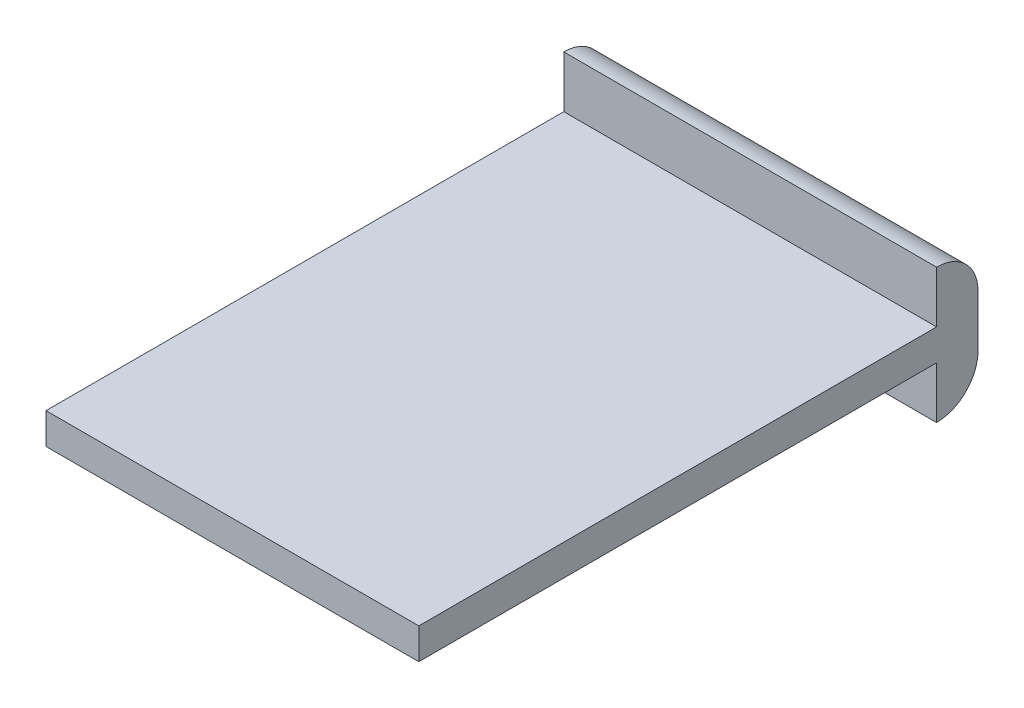
ISO-10303-21;
HEADER;
FILE_DESCRIPTION(('STEP AP214'),'2;1');
FILE_NAME('part.step','',(''),(''),'','','');
FILE_SCHEMA(('AUTOMOTIVE_DESIGN { 1 0 10303 214 1 1 1 1 }'));
ENDSEC;
DATA;
#1=APPLICATION_CONTEXT('core data for automotive mechanical design processes');
#2=APPLICATION_PROTOCOL_DEFINITION('international standard','automotive_design',2000,#1);
#3=PRODUCT_CONTEXT('',#1,'mechanical');
#4=PRODUCT('Part','Part','',(#3));
#5=PRODUCT_RELATED_PRODUCT_CATEGORY('part','',(#4));
#6=PRODUCT_DEFINITION_FORMATION('','',#4);
#7=PRODUCT_DEFINITION_CONTEXT('part definition',#1,'design');
#8=PRODUCT_DEFINITION('design','',#6,#7);
#9=PRODUCT_DEFINITION_SHAPE('','',#8);
#10=(LENGTH_UNIT() NAMED_UNIT(*) SI_UNIT(.MILLI.,.METRE.));
#11=(NAMED_UNIT(*) PLANE_ANGLE_UNIT() SI_UNIT($,.RADIAN.));
#12=(NAMED_UNIT(*) SI_UNIT($,.STERADIAN.) SOLID_ANGLE_UNIT());
#13=UNCERTAINTY_MEASURE_WITH_UNIT(LENGTH_MEASURE(1.E-05),#10,'distance_accuracy_value','');
#14=(GEOMETRIC_REPRESENTATION_CONTEXT(3) GLOBAL_UNCERTAINTY_ASSIGNED_CONTEXT((#13)) GLOBAL_UNIT_ASSIGNED_CONTEXT((#10,
#11,#12)) REPRESENTATION_CONTEXT('',''));
#15=CARTESIAN_POINT('',(0.,0.,0.));
#16=DIRECTION('',(0.,0.,1.));
#17=DIRECTION('',(1.,0.,0.));
#18=AXIS2_PLACEMENT_3D('',#15,#16,#17);
#19=CARTESIAN_POINT('',(0.,1.5,0.));
#20=DIRECTION('',(1.,0.,0.));
#21=DIRECTION('',(0.,0.,-1.));
#22=AXIS2_PLACEMENT_3D('',#19,#20,#21);
#23=PLANE('',#22);
#24=DIRECTION('',(0.,1.,0.));
#25=VECTOR('',#24,1.);
#26=CARTESIAN_POINT('',(0.,-2.5,-25.));
#27=LINE('',#26,#25);
#28=CARTESIAN_POINT('',(0.,1.5,-25.));
#29=VERTEX_POINT('',#28);
#30=CARTESIAN_POINT('',(0.,4.,-25.));
#31=VERTEX_POINT('',#30);
#32=EDGE_CURVE('E115',#29,#31,#27,.T.);
#33=ORIENTED_EDGE('',*,*,#32,.T.);
#34=CARTESIAN_POINT('',(0.,2.,-25.));
#35=DIRECTION('',(1.,0.,0.));
#36=DIRECTION('',(0.,0.,-1.));
#37=AXIS2_PLACEMENT_3D('',#34,#35,#36);
#38=CIRCLE('',#37,2.);
#39=CARTESIAN_POINT('',(0.,2.,-27.));
#40=VERTEX_POINT('',#39);
#41=EDGE_CURVE('E11',#31,#40,#38,.F.);
#42=ORIENTED_EDGE('',*,*,#41,.T.);
#43=DIRECTION('',(0.,1.,0.));
#44=VECTOR('',#43,1.);
#45=CARTESIAN_POINT('',(0.,-2.5,-27.));
#46=LINE('',#45,#44);
#47=CARTESIAN_POINT('',(0.,-0.500000000000001,-27.));
#48=VERTEX_POINT('',#47);
#49=EDGE_CURVE('E127',#48,#40,#46,.T.);
#50=ORIENTED_EDGE('',*,*,#49,.F.);
#51=CARTESIAN_POINT('',(0.,-0.5,-25.));
#52=DIRECTION('',(1.,0.,0.));
#53=DIRECTION('',(0.,0.,-1.));
#54=AXIS2_PLACEMENT_3D('',#51,#52,#53);
#55=CIRCLE('',#54,2.);
#56=CARTESIAN_POINT('',(0.,-2.5,-25.));
#57=VERTEX_POINT('',#56);
#58=EDGE_CURVE('E41',#48,#57,#55,.F.);
#59=ORIENTED_EDGE('',*,*,#58,.T.);
#60=CARTESIAN_POINT('',(0.,0.,-25.));
#61=VERTEX_POINT('',#60);
#62=EDGE_CURVE('E114',#57,#61,#27,.T.);
#63=ORIENTED_EDGE('',*,*,#62,.T.);
#64=DIRECTION('',(0.,0.,1.));
#65=VECTOR('',#64,1.);
#66=CARTESIAN_POINT('',(0.,0.,0.));
#67=LINE('',#66,#65);
#68=CARTESIAN_POINT('',(0.,0.,0.));
#69=VERTEX_POINT('',#68);
#70=EDGE_CURVE('E130',#61,#69,#67,.T.);
#71=ORIENTED_EDGE('',*,*,#70,.T.);
#72=DIRECTION('',(0.,-1.,0.));
#73=VECTOR('',#72,1.);
#74=CARTESIAN_POINT('',(0.,1.5,0.));
#75=LINE('',#74,#73);
#76=CARTESIAN_POINT('',(0.,1.5,0.));
#77=VERTEX_POINT('',#76);
#78=EDGE_CURVE('E190',#77,#69,#75,.T.);
#79=ORIENTED_EDGE('',*,*,#78,.F.);
#80=DIRECTION('',(0.,0.,1.));
#81=VECTOR('',#80,1.);
#82=CARTESIAN_POINT('',(0.,1.5,0.));
#83=LINE('',#82,#81);
#84=EDGE_CURVE('E154',#29,#77,#83,.T.);
#85=ORIENTED_EDGE('',*,*,#84,.F.);
#86=EDGE_LOOP('',(#33,#42,#50,#59,#63,#71,#79,#85));
#87=FACE_BOUND('',#86,.T.);
#88=ADVANCED_FACE('F33',(#87),#23,.F.);
#89=CARTESIAN_POINT('',(0.,1.5,0.));
#90=DIRECTION('',(0.,0.,-1.));
#91=DIRECTION('',(-1.,0.,0.));
#92=AXIS2_PLACEMENT_3D('',#89,#90,#91);
#93=PLANE('',#92);
#94=DIRECTION('',(1.,0.,0.));
#95=VECTOR('',#94,1.);
#96=CARTESIAN_POINT('',(0.,0.,0.));
#97=LINE('',#96,#95);
#98=CARTESIAN_POINT('',(18.,0.,0.));
#99=VERTEX_POINT('',#98);
#100=EDGE_CURVE('E133',#69,#99,#97,.T.);
#101=ORIENTED_EDGE('',*,*,#100,.T.);
#102=DIRECTION('',(0.,-1.,0.));
#103=VECTOR('',#102,1.);
#104=CARTESIAN_POINT('',(18.,1.5,0.));
#105=LINE('',#104,#103);
#106=CARTESIAN_POINT('',(18.,1.5,0.));
#107=VERTEX_POINT('',#106);
#108=EDGE_CURVE('E171',#107,#99,#105,.T.);
#109=ORIENTED_EDGE('',*,*,#108,.F.);
#110=DIRECTION('',(1.,0.,0.));
#111=VECTOR('',#110,1.);
#112=CARTESIAN_POINT('',(0.,1.5,0.));
#113=LINE('',#112,#111);
#114=EDGE_CURVE('E168',#77,#107,#113,.T.);
#115=ORIENTED_EDGE('',*,*,#114,.F.);
#116=ORIENTED_EDGE('',*,*,#78,.T.);
#117=EDGE_LOOP('',(#101,#109,#115,#116));
#118=FACE_BOUND('',#117,.T.);
#119=ADVANCED_FACE('F194',(#118),#93,.F.);
#120=CARTESIAN_POINT('',(18.,1.5,0.));
#121=DIRECTION('',(-1.,0.,0.));
#122=DIRECTION('',(0.,0.,1.));
#123=AXIS2_PLACEMENT_3D('',#120,#121,#122);
#124=PLANE('',#123);
#125=DIRECTION('',(0.,-1.,0.));
#126=VECTOR('',#125,1.);
#127=CARTESIAN_POINT('',(18.,4.,-27.));
#128=LINE('',#127,#126);
#129=CARTESIAN_POINT('',(18.,2.,-27.));
#130=VERTEX_POINT('',#129);
#131=CARTESIAN_POINT('',(18.,-0.5,-27.));
#132=VERTEX_POINT('',#131);
#133=EDGE_CURVE('E131',#130,#132,#128,.T.);
#134=ORIENTED_EDGE('',*,*,#133,.F.);
#135=CARTESIAN_POINT('',(18.,2.,-25.));
#136=DIRECTION('',(-1.,0.,0.));
#137=DIRECTION('',(0.,0.,1.));
#138=AXIS2_PLACEMENT_3D('',#135,#136,#137);
#139=CIRCLE('',#138,2.);
#140=CARTESIAN_POINT('',(18.,4.,-25.));
#141=VERTEX_POINT('',#140);
#142=EDGE_CURVE('E118',#130,#141,#139,.F.);
#143=ORIENTED_EDGE('',*,*,#142,.T.);
#144=DIRECTION('',(0.,-1.,0.));
#145=VECTOR('',#144,1.);
#146=CARTESIAN_POINT('',(18.,0.,-25.));
#147=LINE('',#146,#145);
#148=CARTESIAN_POINT('',(18.,1.5,-25.));
#149=VERTEX_POINT('',#148);
#150=EDGE_CURVE('E108',#141,#149,#147,.T.);
#151=ORIENTED_EDGE('',*,*,#150,.T.);
#152=DIRECTION('',(0.,0.,-1.));
#153=VECTOR('',#152,1.);
#154=CARTESIAN_POINT('',(18.,1.5,0.));
#155=LINE('',#154,#153);
#156=EDGE_CURVE('E164',#107,#149,#155,.T.);
#157=ORIENTED_EDGE('',*,*,#156,.F.);
#158=ORIENTED_EDGE('',*,*,#108,.T.);
#159=DIRECTION('',(0.,0.,-1.));
#160=VECTOR('',#159,1.);
#161=CARTESIAN_POINT('',(18.,0.,0.));
#162=LINE('',#161,#160);
#163=CARTESIAN_POINT('',(18.,0.,-25.));
#164=VERTEX_POINT('',#163);
#165=EDGE_CURVE('E105',#99,#164,#162,.T.);
#166=ORIENTED_EDGE('',*,*,#165,.T.);
#167=CARTESIAN_POINT('',(18.,-2.5,-25.));
#168=VERTEX_POINT('',#167);
#169=EDGE_CURVE('E96',#164,#168,#147,.T.);
#170=ORIENTED_EDGE('',*,*,#169,.T.);
#171=CARTESIAN_POINT('',(18.,-0.5,-25.));
#172=DIRECTION('',(-1.,0.,0.));
#173=DIRECTION('',(0.,0.,1.));
#174=AXIS2_PLACEMENT_3D('',#171,#172,#173);
#175=CIRCLE('',#174,2.);
#176=EDGE_CURVE('E101',#168,#132,#175,.F.);
#177=ORIENTED_EDGE('',*,*,#176,.T.);
#178=EDGE_LOOP('',(#134,#143,#151,#157,#158,#166,#170,#177));
#179=FACE_BOUND('',#178,.T.);
#180=ADVANCED_FACE('F99',(#179),#124,.F.);
#181=CARTESIAN_POINT('',(0.,1.5,0.));
#182=DIRECTION('',(0.,-1.,0.));
#183=DIRECTION('',(0.,0.,-1.));
#184=AXIS2_PLACEMENT_3D('',#181,#182,#183);
#185=PLANE('',#184);
#186=ORIENTED_EDGE('',*,*,#84,.T.);
#187=ORIENTED_EDGE('',*,*,#114,.T.);
#188=ORIENTED_EDGE('',*,*,#156,.T.);
#189=DIRECTION('',(-1.,0.,0.));
#190=VECTOR('',#189,1.);
#191=CARTESIAN_POINT('',(0.,1.5,-25.));
#192=LINE('',#191,#190);
#193=EDGE_CURVE('E167',#149,#29,#192,.T.);
#194=ORIENTED_EDGE('',*,*,#193,.T.);
#195=EDGE_LOOP('',(#186,#187,#188,#194));
#196=FACE_BOUND('',#195,.T.);
#197=ADVANCED_FACE('F166',(#196),#185,.F.);
#198=CARTESIAN_POINT('',(0.,0.,0.));
#199=DIRECTION('',(0.,-1.,0.));
#200=DIRECTION('',(0.,0.,-1.));
#201=AXIS2_PLACEMENT_3D('',#198,#199,#200);
#202=PLANE('',#201);
#203=ORIENTED_EDGE('',*,*,#70,.F.);
#204=DIRECTION('',(-1.,0.,0.));
#205=VECTOR('',#204,1.);
#206=CARTESIAN_POINT('',(0.,0.,-25.));
#207=LINE('',#206,#205);
#208=EDGE_CURVE('E180',#164,#61,#207,.T.);
#209=ORIENTED_EDGE('',*,*,#208,.F.);
#210=ORIENTED_EDGE('',*,*,#165,.F.);
#211=ORIENTED_EDGE('',*,*,#100,.F.);
#212=EDGE_LOOP('',(#203,#209,#210,#211));
#213=FACE_BOUND('',#212,.T.);
#214=ADVANCED_FACE('F196',(#213),#202,.T.);
#215=CARTESIAN_POINT('',(0.,0.,-25.));
#216=DIRECTION('',(0.,0.,-1.));
#217=DIRECTION('',(-1.,0.,0.));
#218=AXIS2_PLACEMENT_3D('',#215,#216,#217);
#219=PLANE('',#218);
#220=ORIENTED_EDGE('',*,*,#169,.F.);
#221=ORIENTED_EDGE('',*,*,#208,.T.);
#222=ORIENTED_EDGE('',*,*,#62,.F.);
#223=DIRECTION('',(-1.,0.,0.));
#224=VECTOR('',#223,1.);
#225=CARTESIAN_POINT('',(18.,-2.5,-25.));
#226=LINE('',#225,#224);
#227=EDGE_CURVE('E111',#168,#57,#226,.T.);
#228=ORIENTED_EDGE('',*,*,#227,.F.);
#229=EDGE_LOOP('',(#220,#221,#222,#228));
#230=FACE_BOUND('',#229,.T.);
#231=ADVANCED_FACE('F112',(#230),#219,.F.);
#232=CARTESIAN_POINT('',(0.,0.,-27.));
#233=DIRECTION('',(0.,0.,-1.));
#234=DIRECTION('',(-1.,0.,0.));
#235=AXIS2_PLACEMENT_3D('',#232,#233,#234);
#236=PLANE('',#235);
#237=ORIENTED_EDGE('',*,*,#49,.T.);
#238=DIRECTION('',(1.,0.,0.));
#239=VECTOR('',#238,1.);
#240=CARTESIAN_POINT('',(18.,2.,-27.));
#241=LINE('',#240,#239);
#242=EDGE_CURVE('E119',#40,#130,#241,.T.);
#243=ORIENTED_EDGE('',*,*,#242,.T.);
#244=ORIENTED_EDGE('',*,*,#133,.T.);
#245=DIRECTION('',(-1.,0.,0.));
#246=VECTOR('',#245,1.);
#247=CARTESIAN_POINT('',(0.,-0.5,-27.));
#248=LINE('',#247,#246);
#249=EDGE_CURVE('E117',#132,#48,#248,.T.);
#250=ORIENTED_EDGE('',*,*,#249,.T.);
#251=EDGE_LOOP('',(#237,#243,#244,#250));
#252=FACE_BOUND('',#251,.T.);
#253=ADVANCED_FACE('F161',(#252),#236,.T.);
#254=ORIENTED_EDGE('',*,*,#193,.F.);
#255=ORIENTED_EDGE('',*,*,#150,.F.);
#256=DIRECTION('',(1.,0.,0.));
#257=VECTOR('',#256,1.);
#258=CARTESIAN_POINT('',(0.,4.,-25.));
#259=LINE('',#258,#257);
#260=EDGE_CURVE('E135',#31,#141,#259,.T.);
#261=ORIENTED_EDGE('',*,*,#260,.F.);
#262=ORIENTED_EDGE('',*,*,#32,.F.);
#263=EDGE_LOOP('',(#254,#255,#261,#262));
#264=FACE_BOUND('',#263,.T.);
#265=ADVANCED_FACE('F158',(#264),#219,.F.);
#266=CARTESIAN_POINT('',(0.,2.,-25.));
#267=DIRECTION('',(-1.,0.,0.));
#268=DIRECTION('',(0.,-1.,0.));
#269=AXIS2_PLACEMENT_3D('',#266,#267,#268);
#270=CYLINDRICAL_SURFACE('',#269,2.);
#271=ORIENTED_EDGE('',*,*,#41,.F.);
#272=ORIENTED_EDGE('',*,*,#260,.T.);
#273=ORIENTED_EDGE('',*,*,#142,.F.);
#274=ORIENTED_EDGE('',*,*,#242,.F.);
#275=EDGE_LOOP('',(#271,#272,#273,#274));
#276=FACE_BOUND('',#275,.T.);
#277=ADVANCED_FACE('F160',(#276),#270,.T.);
#278=CARTESIAN_POINT('',(0.,-0.5,-25.));
#279=DIRECTION('',(1.,0.,0.));
#280=DIRECTION('',(0.,0.,-1.));
#281=AXIS2_PLACEMENT_3D('',#278,#279,#280);
#282=CYLINDRICAL_SURFACE('',#281,2.);
#283=ORIENTED_EDGE('',*,*,#176,.F.);
#284=ORIENTED_EDGE('',*,*,#227,.T.);
#285=ORIENTED_EDGE('',*,*,#58,.F.);
#286=ORIENTED_EDGE('',*,*,#249,.F.);
#287=EDGE_LOOP('',(#283,#284,#285,#286));
#288=FACE_BOUND('',#287,.T.);
#289=ADVANCED_FACE('F35',(#288),#282,.T.);
#290=CLOSED_SHELL('',(#88,#119,#180,#197,#214,#231,#253,#265,#277,#289));
#291=MANIFOLD_SOLID_BREP('B2',#290);
#292=ADVANCED_BREP_SHAPE_REPRESENTATION('',(#18,#291),#14);
#293=SHAPE_DEFINITION_REPRESENTATION(#9,#292);
ENDSEC;
END-ISO-10303-21;
